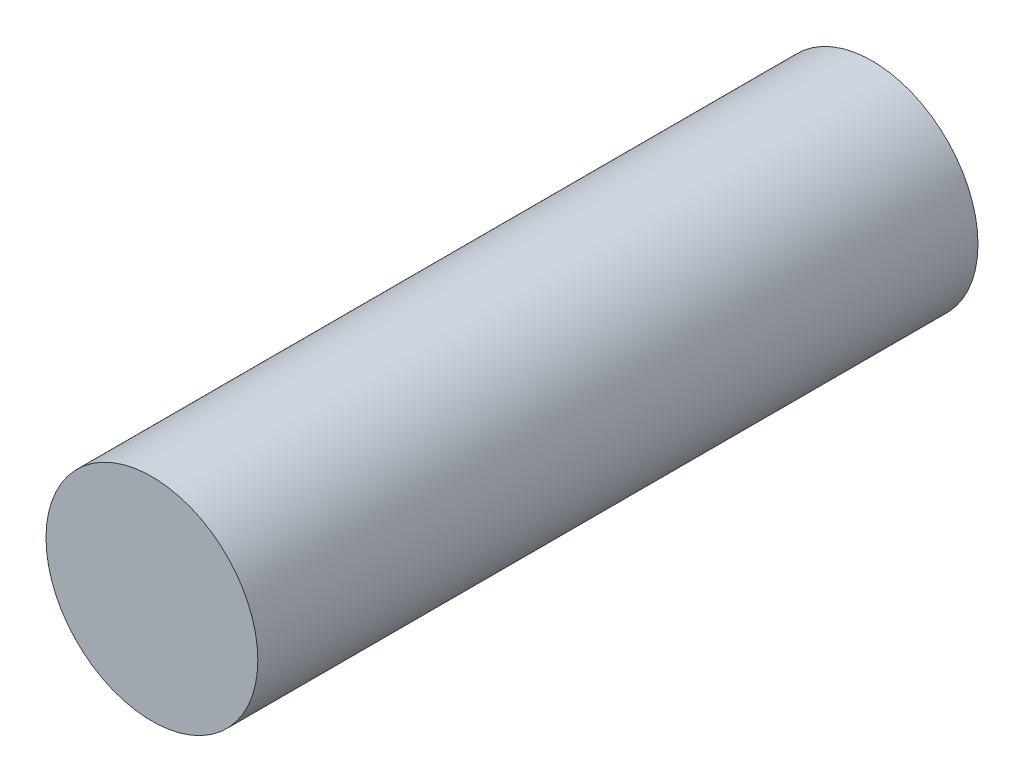
ISO-10303-21;
HEADER;
FILE_DESCRIPTION(('STEP AP214'),'2;1');
FILE_NAME('part.step','',(''),(''),'','','');
FILE_SCHEMA(('AUTOMOTIVE_DESIGN { 1 0 10303 214 1 1 1 1 }'));
ENDSEC;
DATA;
#1=APPLICATION_CONTEXT('core data for automotive mechanical design processes');
#2=APPLICATION_PROTOCOL_DEFINITION('international standard','automotive_design',2000,#1);
#3=PRODUCT_CONTEXT('',#1,'mechanical');
#4=PRODUCT('Part','Part','',(#3));
#5=PRODUCT_RELATED_PRODUCT_CATEGORY('part','',(#4));
#6=PRODUCT_DEFINITION_FORMATION('','',#4);
#7=PRODUCT_DEFINITION_CONTEXT('part definition',#1,'design');
#8=PRODUCT_DEFINITION('design','',#6,#7);
#9=PRODUCT_DEFINITION_SHAPE('','',#8);
#10=(LENGTH_UNIT() NAMED_UNIT(*) SI_UNIT(.MILLI.,.METRE.));
#11=(NAMED_UNIT(*) PLANE_ANGLE_UNIT() SI_UNIT($,.RADIAN.));
#12=(NAMED_UNIT(*) SI_UNIT($,.STERADIAN.) SOLID_ANGLE_UNIT());
#13=UNCERTAINTY_MEASURE_WITH_UNIT(LENGTH_MEASURE(1.E-05),#10,'distance_accuracy_value','');
#14=(GEOMETRIC_REPRESENTATION_CONTEXT(3) GLOBAL_UNCERTAINTY_ASSIGNED_CONTEXT((#13)) GLOBAL_UNIT_ASSIGNED_CONTEXT((#10,
#11,#12)) REPRESENTATION_CONTEXT('',''));
#15=CARTESIAN_POINT('',(0.,0.,0.));
#16=DIRECTION('',(0.,0.,1.));
#17=DIRECTION('',(1.,0.,0.));
#18=AXIS2_PLACEMENT_3D('',#15,#16,#17);
#19=CARTESIAN_POINT('',(0.,0.,170.));
#20=DIRECTION('',(0.,0.,-1.));
#21=DIRECTION('',(-1.,0.,0.));
#22=AXIS2_PLACEMENT_3D('',#19,#20,#21);
#23=CYLINDRICAL_SURFACE('',#22,25.);
#24=CARTESIAN_POINT('',(0.,0.,170.));
#25=DIRECTION('',(0.,0.,1.));
#26=DIRECTION('',(1.,0.,0.));
#27=AXIS2_PLACEMENT_3D('',#24,#25,#26);
#28=CIRCLE('',#27,25.);
#29=CARTESIAN_POINT('',(25.,0.,170.));
#30=VERTEX_POINT('',#29);
#31=EDGE_CURVE('E10',#30,#30,#28,.T.);
#32=ORIENTED_EDGE('',*,*,#31,.F.);
#33=EDGE_LOOP('',(#32));
#34=FACE_BOUND('',#33,.T.);
#35=CARTESIAN_POINT('',(0.,0.,0.));
#36=DIRECTION('',(0.,0.,1.));
#37=DIRECTION('',(1.,0.,0.));
#38=AXIS2_PLACEMENT_3D('',#35,#36,#37);
#39=CIRCLE('',#38,25.);
#40=CARTESIAN_POINT('',(25.,0.,0.));
#41=VERTEX_POINT('',#40);
#42=EDGE_CURVE('E38',#41,#41,#39,.T.);
#43=ORIENTED_EDGE('',*,*,#42,.T.);
#44=EDGE_LOOP('',(#43));
#45=FACE_BOUND('',#44,.T.);
#46=ADVANCED_FACE('F35',(#34,#45),#23,.T.);
#47=CARTESIAN_POINT('',(0.,0.,170.));
#48=DIRECTION('',(0.,0.,1.));
#49=DIRECTION('',(1.,0.,0.));
#50=AXIS2_PLACEMENT_3D('',#47,#48,#49);
#51=PLANE('',#50);
#52=ORIENTED_EDGE('',*,*,#31,.T.);
#53=EDGE_LOOP('',(#52));
#54=FACE_BOUND('',#53,.T.);
#55=ADVANCED_FACE('F50',(#54),#51,.T.);
#56=CARTESIAN_POINT('',(0.,0.,0.));
#57=DIRECTION('',(0.,0.,1.));
#58=DIRECTION('',(1.,0.,0.));
#59=AXIS2_PLACEMENT_3D('',#56,#57,#58);
#60=PLANE('',#59);
#61=ORIENTED_EDGE('',*,*,#42,.F.);
#62=EDGE_LOOP('',(#61));
#63=FACE_BOUND('',#62,.T.);
#64=ADVANCED_FACE('F48',(#63),#60,.F.);
#65=CLOSED_SHELL('',(#46,#55,#64));
#66=MANIFOLD_SOLID_BREP('B2',#65);
#67=ADVANCED_BREP_SHAPE_REPRESENTATION('',(#18,#66),#14);
#68=SHAPE_DEFINITION_REPRESENTATION(#9,#67);
ENDSEC;
END-ISO-10303-21;
